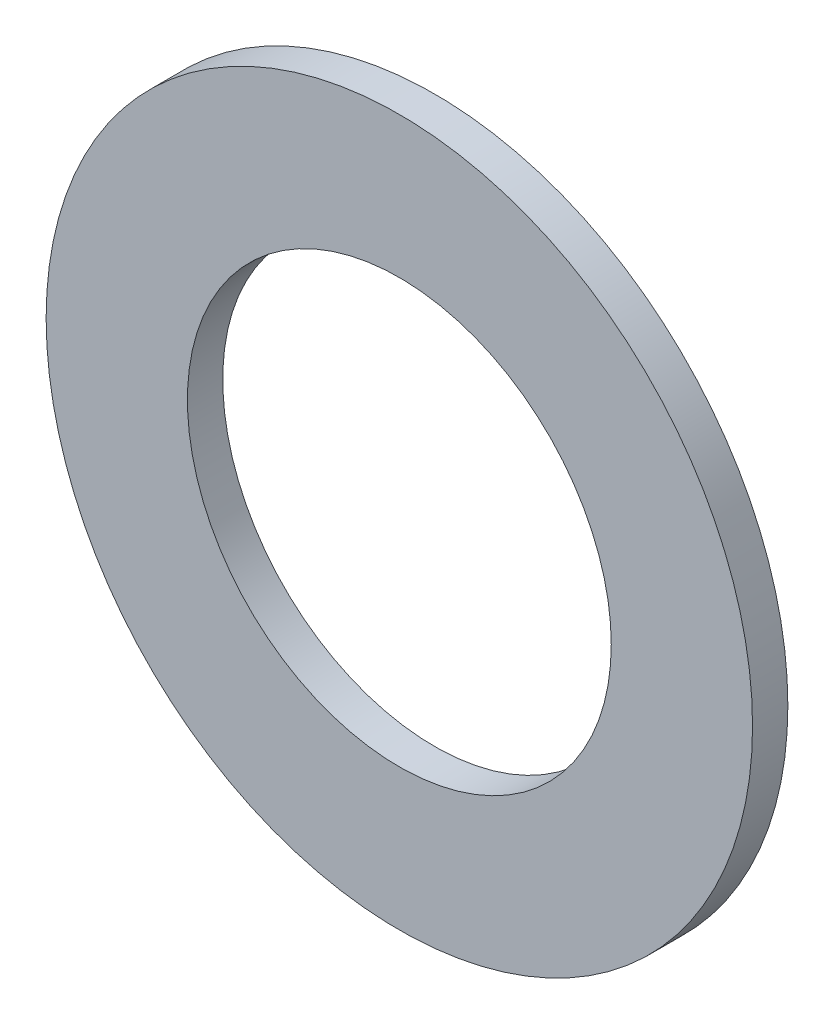
ISO-10303-21;
HEADER;
FILE_DESCRIPTION(('STEP AP214'),'2;1');
FILE_NAME('part.step','',(''),(''),'','','');
FILE_SCHEMA(('AUTOMOTIVE_DESIGN { 1 0 10303 214 1 1 1 1 }'));
ENDSEC;
DATA;
#1=APPLICATION_CONTEXT('core data for automotive mechanical design processes');
#2=APPLICATION_PROTOCOL_DEFINITION('international standard','automotive_design',2000,#1);
#3=PRODUCT_CONTEXT('',#1,'mechanical');
#4=PRODUCT('Part','Part','',(#3));
#5=PRODUCT_RELATED_PRODUCT_CATEGORY('part','',(#4));
#6=PRODUCT_DEFINITION_FORMATION('','',#4);
#7=PRODUCT_DEFINITION_CONTEXT('part definition',#1,'design');
#8=PRODUCT_DEFINITION('design','',#6,#7);
#9=PRODUCT_DEFINITION_SHAPE('','',#8);
#10=(LENGTH_UNIT() NAMED_UNIT(*) SI_UNIT(.MILLI.,.METRE.));
#11=(NAMED_UNIT(*) PLANE_ANGLE_UNIT() SI_UNIT($,.RADIAN.));
#12=(NAMED_UNIT(*) SI_UNIT($,.STERADIAN.) SOLID_ANGLE_UNIT());
#13=UNCERTAINTY_MEASURE_WITH_UNIT(LENGTH_MEASURE(1.E-05),#10,'distance_accuracy_value','');
#14=(GEOMETRIC_REPRESENTATION_CONTEXT(3) GLOBAL_UNCERTAINTY_ASSIGNED_CONTEXT((#13)) GLOBAL_UNIT_ASSIGNED_CONTEXT((#10,
#11,#12)) REPRESENTATION_CONTEXT('',''));
#15=CARTESIAN_POINT('',(0.,0.,0.));
#16=DIRECTION('',(0.,0.,1.));
#17=DIRECTION('',(1.,0.,0.));
#18=AXIS2_PLACEMENT_3D('',#15,#16,#17);
#19=CARTESIAN_POINT('',(0.,0.,1.27));
#20=DIRECTION('',(0.,0.,1.));
#21=DIRECTION('',(1.,0.,0.));
#22=AXIS2_PLACEMENT_3D('',#19,#20,#21);
#23=PLANE('',#22);
#24=CARTESIAN_POINT('',(0.,0.,1.27));
#25=DIRECTION('',(0.,0.,1.));
#26=DIRECTION('',(1.,0.,0.));
#27=AXIS2_PLACEMENT_3D('',#24,#25,#26);
#28=CIRCLE('',#27,12.7);
#29=CARTESIAN_POINT('',(12.7,0.,1.27));
#30=VERTEX_POINT('',#29);
#31=EDGE_CURVE('E10',#30,#30,#28,.T.);
#32=ORIENTED_EDGE('',*,*,#31,.T.);
#33=EDGE_LOOP('',(#32));
#34=FACE_BOUND('',#33,.T.);
#35=CARTESIAN_POINT('',(0.,0.,1.27));
#36=DIRECTION('',(0.,0.,1.));
#37=DIRECTION('',(1.,0.,0.));
#38=AXIS2_PLACEMENT_3D('',#35,#36,#37);
#39=CIRCLE('',#38,7.62);
#40=CARTESIAN_POINT('',(7.62,0.,1.27));
#41=VERTEX_POINT('',#40);
#42=EDGE_CURVE('E44',#41,#41,#39,.T.);
#43=ORIENTED_EDGE('',*,*,#42,.F.);
#44=EDGE_LOOP('',(#43));
#45=FACE_BOUND('',#44,.T.);
#46=ADVANCED_FACE('F33',(#34,#45),#23,.T.);
#47=CARTESIAN_POINT('',(0.,0.,0.));
#48=DIRECTION('',(0.,0.,1.));
#49=DIRECTION('',(1.,0.,0.));
#50=AXIS2_PLACEMENT_3D('',#47,#48,#49);
#51=PLANE('',#50);
#52=CARTESIAN_POINT('',(0.,0.,0.));
#53=DIRECTION('',(0.,0.,1.));
#54=DIRECTION('',(1.,0.,0.));
#55=AXIS2_PLACEMENT_3D('',#52,#53,#54);
#56=CIRCLE('',#55,12.7);
#57=CARTESIAN_POINT('',(12.7,0.,0.));
#58=VERTEX_POINT('',#57);
#59=EDGE_CURVE('E37',#58,#58,#56,.T.);
#60=ORIENTED_EDGE('',*,*,#59,.F.);
#61=EDGE_LOOP('',(#60));
#62=FACE_BOUND('',#61,.T.);
#63=CARTESIAN_POINT('',(0.,0.,0.));
#64=DIRECTION('',(0.,0.,1.));
#65=DIRECTION('',(1.,0.,0.));
#66=AXIS2_PLACEMENT_3D('',#63,#64,#65);
#67=CIRCLE('',#66,7.62);
#68=CARTESIAN_POINT('',(7.62,0.,0.));
#69=VERTEX_POINT('',#68);
#70=EDGE_CURVE('E46',#69,#69,#67,.T.);
#71=ORIENTED_EDGE('',*,*,#70,.T.);
#72=EDGE_LOOP('',(#71));
#73=FACE_BOUND('',#72,.T.);
#74=ADVANCED_FACE('F56',(#62,#73),#51,.F.);
#75=CARTESIAN_POINT('',(0.,0.,1.27));
#76=DIRECTION('',(0.,0.,-1.));
#77=DIRECTION('',(-1.,0.,0.));
#78=AXIS2_PLACEMENT_3D('',#75,#76,#77);
#79=CYLINDRICAL_SURFACE('',#78,12.7);
#80=ORIENTED_EDGE('',*,*,#31,.F.);
#81=EDGE_LOOP('',(#80));
#82=FACE_BOUND('',#81,.T.);
#83=ORIENTED_EDGE('',*,*,#59,.T.);
#84=EDGE_LOOP('',(#83));
#85=FACE_BOUND('',#84,.T.);
#86=ADVANCED_FACE('F35',(#82,#85),#79,.T.);
#87=CARTESIAN_POINT('',(0.,0.,1.27));
#88=DIRECTION('',(0.,0.,-1.));
#89=DIRECTION('',(-1.,0.,0.));
#90=AXIS2_PLACEMENT_3D('',#87,#88,#89);
#91=CYLINDRICAL_SURFACE('',#90,7.62);
#92=ORIENTED_EDGE('',*,*,#42,.T.);
#93=EDGE_LOOP('',(#92));
#94=FACE_BOUND('',#93,.T.);
#95=ORIENTED_EDGE('',*,*,#70,.F.);
#96=EDGE_LOOP('',(#95));
#97=FACE_BOUND('',#96,.T.);
#98=ADVANCED_FACE('F52',(#94,#97),#91,.F.);
#99=CLOSED_SHELL('',(#46,#74,#86,#98));
#100=MANIFOLD_SOLID_BREP('B2',#99);
#101=ADVANCED_BREP_SHAPE_REPRESENTATION('',(#18,#100),#14);
#102=SHAPE_DEFINITION_REPRESENTATION(#9,#101);
ENDSEC;
END-ISO-10303-21;
